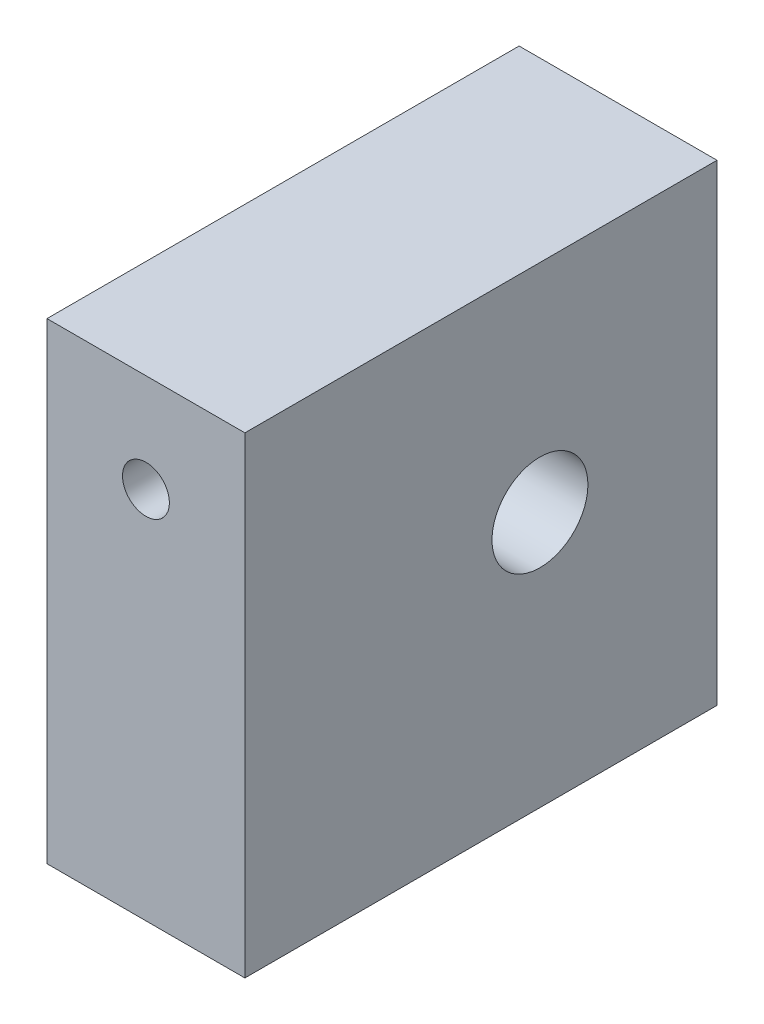
ISO-10303-21;
HEADER;
FILE_DESCRIPTION(('STEP AP214'),'2;1');
FILE_NAME('part.step','',(''),(''),'','','');
FILE_SCHEMA(('AUTOMOTIVE_DESIGN { 1 0 10303 214 1 1 1 1 }'));
ENDSEC;
DATA;
#1=APPLICATION_CONTEXT('core data for automotive mechanical design processes');
#2=APPLICATION_PROTOCOL_DEFINITION('international standard','automotive_design',2000,#1);
#3=PRODUCT_CONTEXT('',#1,'mechanical');
#4=PRODUCT('Part','Part','',(#3));
#5=PRODUCT_RELATED_PRODUCT_CATEGORY('part','',(#4));
#6=PRODUCT_DEFINITION_FORMATION('','',#4);
#7=PRODUCT_DEFINITION_CONTEXT('part definition',#1,'design');
#8=PRODUCT_DEFINITION('design','',#6,#7);
#9=PRODUCT_DEFINITION_SHAPE('','',#8);
#10=(LENGTH_UNIT() NAMED_UNIT(*) SI_UNIT(.MILLI.,.METRE.));
#11=(NAMED_UNIT(*) PLANE_ANGLE_UNIT() SI_UNIT($,.RADIAN.));
#12=(NAMED_UNIT(*) SI_UNIT($,.STERADIAN.) SOLID_ANGLE_UNIT());
#13=UNCERTAINTY_MEASURE_WITH_UNIT(LENGTH_MEASURE(1.E-05),#10,'distance_accuracy_value','');
#14=(GEOMETRIC_REPRESENTATION_CONTEXT(3) GLOBAL_UNCERTAINTY_ASSIGNED_CONTEXT((#13)) GLOBAL_UNIT_ASSIGNED_CONTEXT((#10,
#11,#12)) REPRESENTATION_CONTEXT('',''));
#15=CARTESIAN_POINT('',(0.,0.,0.));
#16=DIRECTION('',(0.,0.,1.));
#17=DIRECTION('',(1.,0.,0.));
#18=AXIS2_PLACEMENT_3D('',#15,#16,#17);
#19=CARTESIAN_POINT('',(5.03,0.,0.));
#20=DIRECTION('',(0.,0.,-1.));
#21=DIRECTION('',(-1.,0.,0.));
#22=AXIS2_PLACEMENT_3D('',#19,#20,#21);
#23=PLANE('',#22);
#24=CARTESIAN_POINT('',(2.515,9.5,0.));
#25=DIRECTION('',(0.,0.,1.));
#26=DIRECTION('',(1.,0.,0.));
#27=AXIS2_PLACEMENT_3D('',#24,#25,#26);
#28=CIRCLE('',#27,0.595629999999989);
#29=CARTESIAN_POINT('',(3.11062999999999,9.5,0.));
#30=VERTEX_POINT('',#29);
#31=EDGE_CURVE('E95',#30,#30,#28,.T.);
#32=ORIENTED_EDGE('',*,*,#31,.F.);
#33=EDGE_LOOP('',(#32));
#34=FACE_BOUND('',#33,.T.);
#35=DIRECTION('',(0.,-1.,0.));
#36=VECTOR('',#35,1.);
#37=CARTESIAN_POINT('',(0.,0.,0.));
#38=LINE('',#37,#36);
#39=CARTESIAN_POINT('',(0.,12.,0.));
#40=VERTEX_POINT('',#39);
#41=CARTESIAN_POINT('',(0.,0.,0.));
#42=VERTEX_POINT('',#41);
#43=EDGE_CURVE('E94',#40,#42,#38,.T.);
#44=ORIENTED_EDGE('',*,*,#43,.T.);
#45=DIRECTION('',(-1.,0.,0.));
#46=VECTOR('',#45,1.);
#47=CARTESIAN_POINT('',(5.03,0.,0.));
#48=LINE('',#47,#46);
#49=CARTESIAN_POINT('',(5.03,0.,0.));
#50=VERTEX_POINT('',#49);
#51=EDGE_CURVE('E11',#50,#42,#48,.T.);
#52=ORIENTED_EDGE('',*,*,#51,.F.);
#53=DIRECTION('',(0.,-1.,0.));
#54=VECTOR('',#53,1.);
#55=CARTESIAN_POINT('',(5.03,0.,0.));
#56=LINE('',#55,#54);
#57=CARTESIAN_POINT('',(5.03,12.,0.));
#58=VERTEX_POINT('',#57);
#59=EDGE_CURVE('E105',#58,#50,#56,.T.);
#60=ORIENTED_EDGE('',*,*,#59,.F.);
#61=DIRECTION('',(-1.,0.,0.));
#62=VECTOR('',#61,1.);
#63=CARTESIAN_POINT('',(5.03,12.,0.));
#64=LINE('',#63,#62);
#65=EDGE_CURVE('E110',#58,#40,#64,.T.);
#66=ORIENTED_EDGE('',*,*,#65,.T.);
#67=EDGE_LOOP('',(#44,#52,#60,#66));
#68=FACE_BOUND('',#67,.T.);
#69=ADVANCED_FACE('F33',(#34,#68),#23,.F.);
#70=CARTESIAN_POINT('',(5.03,0.,0.));
#71=DIRECTION('',(0.,1.,0.));
#72=DIRECTION('',(0.,0.,1.));
#73=AXIS2_PLACEMENT_3D('',#70,#71,#72);
#74=PLANE('',#73);
#75=DIRECTION('',(0.,0.,-1.));
#76=VECTOR('',#75,1.);
#77=CARTESIAN_POINT('',(0.,0.,0.));
#78=LINE('',#77,#76);
#79=CARTESIAN_POINT('',(0.,0.,-12.));
#80=VERTEX_POINT('',#79);
#81=EDGE_CURVE('E98',#42,#80,#78,.T.);
#82=ORIENTED_EDGE('',*,*,#81,.T.);
#83=DIRECTION('',(-1.,0.,0.));
#84=VECTOR('',#83,1.);
#85=CARTESIAN_POINT('',(5.03,0.,-12.));
#86=LINE('',#85,#84);
#87=CARTESIAN_POINT('',(5.03,0.,-12.));
#88=VERTEX_POINT('',#87);
#89=EDGE_CURVE('E41',#88,#80,#86,.T.);
#90=ORIENTED_EDGE('',*,*,#89,.F.);
#91=DIRECTION('',(0.,0.,-1.));
#92=VECTOR('',#91,1.);
#93=CARTESIAN_POINT('',(5.03,0.,0.));
#94=LINE('',#93,#92);
#95=EDGE_CURVE('E80',#50,#88,#94,.T.);
#96=ORIENTED_EDGE('',*,*,#95,.F.);
#97=ORIENTED_EDGE('',*,*,#51,.T.);
#98=EDGE_LOOP('',(#82,#90,#96,#97));
#99=FACE_BOUND('',#98,.T.);
#100=ADVANCED_FACE('F134',(#99),#74,.F.);
#101=CARTESIAN_POINT('',(5.03,0.,-12.));
#102=DIRECTION('',(0.,0.,1.));
#103=DIRECTION('',(1.,0.,0.));
#104=AXIS2_PLACEMENT_3D('',#101,#102,#103);
#105=PLANE('',#104);
#106=DIRECTION('',(0.,1.,0.));
#107=VECTOR('',#106,1.);
#108=CARTESIAN_POINT('',(0.,0.,-12.));
#109=LINE('',#108,#107);
#110=CARTESIAN_POINT('',(0.,12.,-12.));
#111=VERTEX_POINT('',#110);
#112=EDGE_CURVE('E67',#80,#111,#109,.T.);
#113=ORIENTED_EDGE('',*,*,#112,.T.);
#114=DIRECTION('',(-1.,0.,0.));
#115=VECTOR('',#114,1.);
#116=CARTESIAN_POINT('',(5.03,12.,-12.));
#117=LINE('',#116,#115);
#118=CARTESIAN_POINT('',(5.03,12.,-12.));
#119=VERTEX_POINT('',#118);
#120=EDGE_CURVE('E116',#119,#111,#117,.T.);
#121=ORIENTED_EDGE('',*,*,#120,.F.);
#122=DIRECTION('',(0.,1.,0.));
#123=VECTOR('',#122,1.);
#124=CARTESIAN_POINT('',(5.03,0.,-12.));
#125=LINE('',#124,#123);
#126=EDGE_CURVE('E108',#88,#119,#125,.T.);
#127=ORIENTED_EDGE('',*,*,#126,.F.);
#128=ORIENTED_EDGE('',*,*,#89,.T.);
#129=EDGE_LOOP('',(#113,#121,#127,#128));
#130=FACE_BOUND('',#129,.T.);
#131=ADVANCED_FACE('F118',(#130),#105,.F.);
#132=CARTESIAN_POINT('',(5.03,12.,0.));
#133=DIRECTION('',(0.,-1.,0.));
#134=DIRECTION('',(0.,0.,-1.));
#135=AXIS2_PLACEMENT_3D('',#132,#133,#134);
#136=PLANE('',#135);
#137=DIRECTION('',(0.,0.,1.));
#138=VECTOR('',#137,1.);
#139=CARTESIAN_POINT('',(0.,12.,0.));
#140=LINE('',#139,#138);
#141=EDGE_CURVE('E73',#111,#40,#140,.T.);
#142=ORIENTED_EDGE('',*,*,#141,.T.);
#143=ORIENTED_EDGE('',*,*,#65,.F.);
#144=DIRECTION('',(0.,0.,1.));
#145=VECTOR('',#144,1.);
#146=CARTESIAN_POINT('',(5.03,12.,0.));
#147=LINE('',#146,#145);
#148=EDGE_CURVE('E49',#119,#58,#147,.T.);
#149=ORIENTED_EDGE('',*,*,#148,.F.);
#150=ORIENTED_EDGE('',*,*,#120,.T.);
#151=EDGE_LOOP('',(#142,#143,#149,#150));
#152=FACE_BOUND('',#151,.T.);
#153=ADVANCED_FACE('F124',(#152),#136,.F.);
#154=CARTESIAN_POINT('',(5.03,0.,0.));
#155=DIRECTION('',(-1.,0.,0.));
#156=DIRECTION('',(0.,0.,1.));
#157=AXIS2_PLACEMENT_3D('',#154,#155,#156);
#158=PLANE('',#157);
#159=CARTESIAN_POINT('',(5.03,6.50000000000001,-7.50000000000001));
#160=DIRECTION('',(1.,0.,0.));
#161=DIRECTION('',(0.,0.,-1.));
#162=AXIS2_PLACEMENT_3D('',#159,#160,#161);
#163=CIRCLE('',#162,1.21919999999999);
#164=CARTESIAN_POINT('',(5.03,6.50000000000001,-8.7192));
#165=VERTEX_POINT('',#164);
#166=EDGE_CURVE('E158',#165,#165,#163,.T.);
#167=ORIENTED_EDGE('',*,*,#166,.F.);
#168=EDGE_LOOP('',(#167));
#169=FACE_BOUND('',#168,.T.);
#170=ORIENTED_EDGE('',*,*,#59,.T.);
#171=ORIENTED_EDGE('',*,*,#95,.T.);
#172=ORIENTED_EDGE('',*,*,#126,.T.);
#173=ORIENTED_EDGE('',*,*,#148,.T.);
#174=EDGE_LOOP('',(#170,#171,#172,#173));
#175=FACE_BOUND('',#174,.T.);
#176=ADVANCED_FACE('F126',(#169,#175),#158,.F.);
#177=CARTESIAN_POINT('',(0.,0.,0.));
#178=DIRECTION('',(-1.,0.,0.));
#179=DIRECTION('',(0.,0.,1.));
#180=AXIS2_PLACEMENT_3D('',#177,#178,#179);
#181=PLANE('',#180);
#182=CARTESIAN_POINT('',(0.,6.50000000000001,-7.50000000000001));
#183=DIRECTION('',(1.,0.,0.));
#184=DIRECTION('',(0.,0.,-1.));
#185=AXIS2_PLACEMENT_3D('',#182,#183,#184);
#186=CIRCLE('',#185,1.2192);
#187=CARTESIAN_POINT('',(0.,6.50000000000001,-8.7192));
#188=VERTEX_POINT('',#187);
#189=EDGE_CURVE('E101',#188,#188,#186,.T.);
#190=ORIENTED_EDGE('',*,*,#189,.T.);
#191=EDGE_LOOP('',(#190));
#192=FACE_BOUND('',#191,.T.);
#193=ORIENTED_EDGE('',*,*,#43,.F.);
#194=ORIENTED_EDGE('',*,*,#141,.F.);
#195=ORIENTED_EDGE('',*,*,#112,.F.);
#196=ORIENTED_EDGE('',*,*,#81,.F.);
#197=EDGE_LOOP('',(#193,#194,#195,#196));
#198=FACE_BOUND('',#197,.T.);
#199=ADVANCED_FACE('F88',(#192,#198),#181,.T.);
#200=CARTESIAN_POINT('',(2.515,9.5,-4.));
#201=DIRECTION('',(0.,0.,1.));
#202=DIRECTION('',(1.,0.,0.));
#203=AXIS2_PLACEMENT_3D('',#200,#201,#202);
#204=CONICAL_SURFACE('',#203,0.595629999999999,1.02974425867665);
#205=CARTESIAN_POINT('',(2.515,9.5,-4.35789061051139));
#206=VERTEX_POINT('',#205);
#207=VERTEX_LOOP('',#206);
#208=FACE_BOUND('',#207,.T.);
#209=CARTESIAN_POINT('',(2.515,9.5,-4.));
#210=DIRECTION('',(0.,0.,1.));
#211=DIRECTION('',(1.,0.,0.));
#212=AXIS2_PLACEMENT_3D('',#209,#210,#211);
#213=CIRCLE('',#212,0.595629999999999);
#214=CARTESIAN_POINT('',(3.11063,9.5,-4.));
#215=VERTEX_POINT('',#214);
#216=EDGE_CURVE('E92',#215,#215,#213,.T.);
#217=ORIENTED_EDGE('',*,*,#216,.T.);
#218=EDGE_LOOP('',(#217));
#219=FACE_BOUND('',#218,.T.);
#220=ADVANCED_FACE('F84',(#208,#219),#204,.F.);
#221=CARTESIAN_POINT('',(2.515,9.5,0.));
#222=DIRECTION('',(0.,0.,1.));
#223=DIRECTION('',(1.,0.,0.));
#224=AXIS2_PLACEMENT_3D('',#221,#222,#223);
#225=CYLINDRICAL_SURFACE('',#224,0.595629999999994);
#226=ORIENTED_EDGE('',*,*,#216,.F.);
#227=EDGE_LOOP('',(#226));
#228=FACE_BOUND('',#227,.T.);
#229=ORIENTED_EDGE('',*,*,#31,.T.);
#230=EDGE_LOOP('',(#229));
#231=FACE_BOUND('',#230,.T.);
#232=ADVANCED_FACE('F87',(#228,#231),#225,.F.);
#233=CARTESIAN_POINT('',(5.03,6.50000000000001,-7.50000000000001));
#234=DIRECTION('',(1.,0.,0.));
#235=DIRECTION('',(0.,0.,-1.));
#236=AXIS2_PLACEMENT_3D('',#233,#234,#235);
#237=CYLINDRICAL_SURFACE('',#236,1.21919999999999);
#238=ORIENTED_EDGE('',*,*,#189,.F.);
#239=EDGE_LOOP('',(#238));
#240=FACE_BOUND('',#239,.T.);
#241=ORIENTED_EDGE('',*,*,#166,.T.);
#242=EDGE_LOOP('',(#241));
#243=FACE_BOUND('',#242,.T.);
#244=ADVANCED_FACE('F145',(#240,#243),#237,.F.);
#245=CLOSED_SHELL('',(#69,#100,#131,#153,#176,#199,#220,#232,#244));
#246=MANIFOLD_SOLID_BREP('B2',#245);
#247=ADVANCED_BREP_SHAPE_REPRESENTATION('',(#18,#246),#14);
#248=SHAPE_DEFINITION_REPRESENTATION(#9,#247);
ENDSEC;
END-ISO-10303-21;
